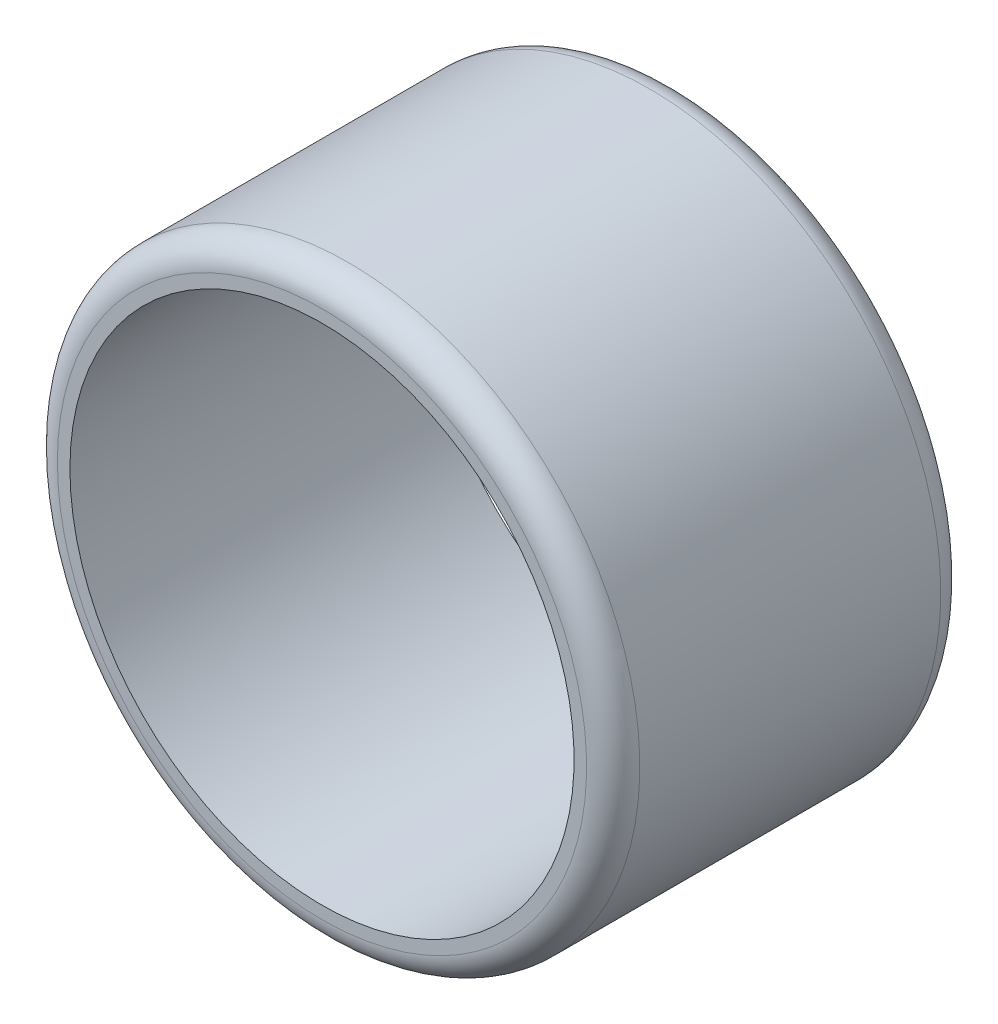
ISO-10303-21;
HEADER;
FILE_DESCRIPTION(('STEP AP214'),'2;1');
FILE_NAME('part.step','',(''),(''),'','','');
FILE_SCHEMA(('AUTOMOTIVE_DESIGN { 1 0 10303 214 1 1 1 1 }'));
ENDSEC;
DATA;
#1=APPLICATION_CONTEXT('core data for automotive mechanical design processes');
#2=APPLICATION_PROTOCOL_DEFINITION('international standard','automotive_design',2000,#1);
#3=PRODUCT_CONTEXT('',#1,'mechanical');
#4=PRODUCT('Part','Part','',(#3));
#5=PRODUCT_RELATED_PRODUCT_CATEGORY('part','',(#4));
#6=PRODUCT_DEFINITION_FORMATION('','',#4);
#7=PRODUCT_DEFINITION_CONTEXT('part definition',#1,'design');
#8=PRODUCT_DEFINITION('design','',#6,#7);
#9=PRODUCT_DEFINITION_SHAPE('','',#8);
#10=(LENGTH_UNIT() NAMED_UNIT(*) SI_UNIT(.MILLI.,.METRE.));
#11=(NAMED_UNIT(*) PLANE_ANGLE_UNIT() SI_UNIT($,.RADIAN.));
#12=(NAMED_UNIT(*) SI_UNIT($,.STERADIAN.) SOLID_ANGLE_UNIT());
#13=UNCERTAINTY_MEASURE_WITH_UNIT(LENGTH_MEASURE(1.E-05),#10,'distance_accuracy_value','');
#14=(GEOMETRIC_REPRESENTATION_CONTEXT(3) GLOBAL_UNCERTAINTY_ASSIGNED_CONTEXT((#13)) GLOBAL_UNIT_ASSIGNED_CONTEXT((#10,
#11,#12)) REPRESENTATION_CONTEXT('',''));
#15=CARTESIAN_POINT('',(0.,0.,0.));
#16=DIRECTION('',(0.,0.,1.));
#17=DIRECTION('',(1.,0.,0.));
#18=AXIS2_PLACEMENT_3D('',#15,#16,#17);
#19=CARTESIAN_POINT('',(-7927.40763591954,2848.66816357867,5434.1848110498));
#20=DIRECTION('',(0.,0.,-1.));
#21=DIRECTION('',(0.,-1.,0.));
#22=AXIS2_PLACEMENT_3D('',#19,#20,#21);
#23=CYLINDRICAL_SURFACE('',#22,1094.33226867246);
#24=CARTESIAN_POINT('',(-7927.40763591954,2848.66816357867,4203.1848110498));
#25=DIRECTION('',(0.,0.,-1.));
#26=DIRECTION('',(-1.,0.,0.));
#27=AXIS2_PLACEMENT_3D('',#24,#25,#26);
#28=CIRCLE('',#27,1094.33226867246);
#29=CARTESIAN_POINT('',(-9021.739904592,2848.66816357867,4203.1848110498));
#30=VERTEX_POINT('',#29);
#31=EDGE_CURVE('E25',#30,#30,#28,.F.);
#32=ORIENTED_EDGE('',*,*,#31,.T.);
#33=EDGE_LOOP('',(#32));
#34=FACE_BOUND('',#33,.T.);
#35=CARTESIAN_POINT('',(-7927.40763591954,2848.66816357867,5334.1848110498));
#36=DIRECTION('',(0.,0.,-1.));
#37=DIRECTION('',(-1.,0.,0.));
#38=AXIS2_PLACEMENT_3D('',#35,#36,#37);
#39=CIRCLE('',#38,1094.33226867246);
#40=CARTESIAN_POINT('',(-9021.739904592,2848.66816357867,5334.1848110498));
#41=VERTEX_POINT('',#40);
#42=EDGE_CURVE('E29',#41,#41,#39,.T.);
#43=ORIENTED_EDGE('',*,*,#42,.T.);
#44=EDGE_LOOP('',(#43));
#45=FACE_BOUND('',#44,.T.);
#46=ADVANCED_FACE('F15',(#34,#45),#23,.T.);
#47=CARTESIAN_POINT('',(-7927.40763591954,2848.66816357867,5434.1848110498));
#48=DIRECTION('',(0.,0.,-1.));
#49=DIRECTION('',(0.,-1.,0.));
#50=AXIS2_PLACEMENT_3D('',#47,#48,#49);
#51=PLANE('',#50);
#52=CARTESIAN_POINT('',(-7927.40763591954,2848.66816357867,5434.1848110498));
#53=DIRECTION('',(0.,0.,-1.));
#54=DIRECTION('',(-1.,0.,0.));
#55=AXIS2_PLACEMENT_3D('',#52,#53,#54);
#56=CIRCLE('',#55,994.33226867246);
#57=CARTESIAN_POINT('',(-8921.739904592,2848.66816357867,5434.1848110498));
#58=VERTEX_POINT('',#57);
#59=EDGE_CURVE('E10',#58,#58,#56,.F.);
#60=ORIENTED_EDGE('',*,*,#59,.T.);
#61=EDGE_LOOP('',(#60));
#62=FACE_BOUND('',#61,.T.);
#63=CARTESIAN_POINT('',(-7927.40763591954,2848.66816357867,5434.1848110498));
#64=DIRECTION('',(0.,0.,-1.));
#65=DIRECTION('',(-1.,0.,0.));
#66=AXIS2_PLACEMENT_3D('',#63,#64,#65);
#67=CIRCLE('',#66,947.263104027568);
#68=CARTESIAN_POINT('',(-8874.67073994711,2848.66816357867,5434.1848110498));
#69=VERTEX_POINT('',#68);
#70=EDGE_CURVE('E34',#69,#69,#67,.T.);
#71=ORIENTED_EDGE('',*,*,#70,.T.);
#72=EDGE_LOOP('',(#71));
#73=FACE_BOUND('',#72,.T.);
#74=ADVANCED_FACE('F41',(#62,#73),#51,.F.);
#75=CARTESIAN_POINT('',(-7927.40763591954,2848.66816357867,4103.1848110498));
#76=DIRECTION('',(0.,0.,-1.));
#77=DIRECTION('',(0.,-1.,0.));
#78=AXIS2_PLACEMENT_3D('',#75,#76,#77);
#79=PLANE('',#78);
#80=CARTESIAN_POINT('',(-7927.40763591954,2848.66816357867,4103.1848110498));
#81=DIRECTION('',(0.,0.,-1.));
#82=DIRECTION('',(-1.,0.,0.));
#83=AXIS2_PLACEMENT_3D('',#80,#81,#82);
#84=CIRCLE('',#83,994.33226867246);
#85=CARTESIAN_POINT('',(-8921.739904592,2848.66816357867,4103.1848110498));
#86=VERTEX_POINT('',#85);
#87=EDGE_CURVE('E21',#86,#86,#84,.T.);
#88=ORIENTED_EDGE('',*,*,#87,.T.);
#89=EDGE_LOOP('',(#88));
#90=FACE_BOUND('',#89,.T.);
#91=CARTESIAN_POINT('',(-7927.40763591954,2848.66816357867,4103.1848110498));
#92=DIRECTION('',(0.,0.,-1.));
#93=DIRECTION('',(-1.,0.,0.));
#94=AXIS2_PLACEMENT_3D('',#91,#92,#93);
#95=CIRCLE('',#94,947.263104027568);
#96=CARTESIAN_POINT('',(-8874.67073994711,2848.66816357867,4103.1848110498));
#97=VERTEX_POINT('',#96);
#98=EDGE_CURVE('E35',#97,#97,#95,.T.);
#99=ORIENTED_EDGE('',*,*,#98,.F.);
#100=EDGE_LOOP('',(#99));
#101=FACE_BOUND('',#100,.T.);
#102=ADVANCED_FACE('F46',(#90,#101),#79,.T.);
#103=CARTESIAN_POINT('',(-7927.40763591954,2848.66816357867,5676.1848110498));
#104=DIRECTION('',(0.,0.,-1.));
#105=DIRECTION('',(-1.,0.,0.));
#106=AXIS2_PLACEMENT_3D('',#103,#104,#105);
#107=CYLINDRICAL_SURFACE('',#106,947.263104027568);
#108=ORIENTED_EDGE('',*,*,#98,.T.);
#109=EDGE_LOOP('',(#108));
#110=FACE_BOUND('',#109,.T.);
#111=ORIENTED_EDGE('',*,*,#70,.F.);
#112=EDGE_LOOP('',(#111));
#113=FACE_BOUND('',#112,.T.);
#114=ADVANCED_FACE('F43',(#110,#113),#107,.F.);
#115=CARTESIAN_POINT('',(-7927.40763591954,2848.66816357867,4203.1848110498));
#116=DIRECTION('',(0.,0.,-1.));
#117=DIRECTION('',(-1.,0.,0.));
#118=AXIS2_PLACEMENT_3D('',#115,#116,#117);
#119=TOROIDAL_SURFACE('',#118,994.33226867246,100.);
#120=ORIENTED_EDGE('',*,*,#87,.F.);
#121=EDGE_LOOP('',(#120));
#122=FACE_BOUND('',#121,.T.);
#123=ORIENTED_EDGE('',*,*,#31,.F.);
#124=EDGE_LOOP('',(#123));
#125=FACE_BOUND('',#124,.T.);
#126=ADVANCED_FACE('F45',(#122,#125),#119,.T.);
#127=CARTESIAN_POINT('',(-7927.40763591954,2848.66816357867,5334.1848110498));
#128=DIRECTION('',(0.,0.,-1.));
#129=DIRECTION('',(-1.,0.,0.));
#130=AXIS2_PLACEMENT_3D('',#127,#128,#129);
#131=TOROIDAL_SURFACE('',#130,994.33226867246,100.);
#132=ORIENTED_EDGE('',*,*,#42,.F.);
#133=EDGE_LOOP('',(#132));
#134=FACE_BOUND('',#133,.T.);
#135=ORIENTED_EDGE('',*,*,#59,.F.);
#136=EDGE_LOOP('',(#135));
#137=FACE_BOUND('',#136,.T.);
#138=ADVANCED_FACE('F54',(#134,#137),#131,.T.);
#139=CLOSED_SHELL('',(#46,#74,#102,#114,#126,#138));
#140=MANIFOLD_SOLID_BREP('B1',#139);
#141=ADVANCED_BREP_SHAPE_REPRESENTATION('',(#18,#140),#14);
#142=SHAPE_DEFINITION_REPRESENTATION(#9,#141);
ENDSEC;
END-ISO-10303-21;
